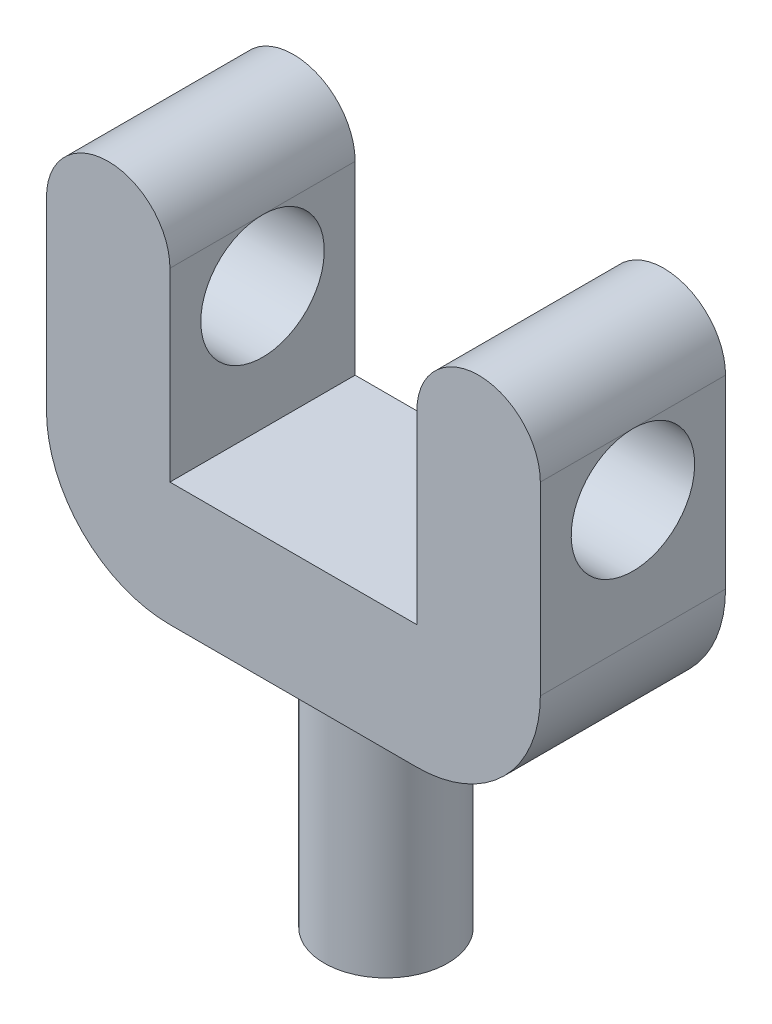
ISO-10303-21;
HEADER;
FILE_DESCRIPTION(('STEP AP214'),'2;1');
FILE_NAME('part.step','',(''),(''),'','','');
FILE_SCHEMA(('AUTOMOTIVE_DESIGN { 1 0 10303 214 1 1 1 1 }'));
ENDSEC;
DATA;
#1=APPLICATION_CONTEXT('core data for automotive mechanical design processes');
#2=APPLICATION_PROTOCOL_DEFINITION('international standard','automotive_design',2000,#1);
#3=PRODUCT_CONTEXT('',#1,'mechanical');
#4=PRODUCT('Part','Part','',(#3));
#5=PRODUCT_RELATED_PRODUCT_CATEGORY('part','',(#4));
#6=PRODUCT_DEFINITION_FORMATION('','',#4);
#7=PRODUCT_DEFINITION_CONTEXT('part definition',#1,'design');
#8=PRODUCT_DEFINITION('design','',#6,#7);
#9=PRODUCT_DEFINITION_SHAPE('','',#8);
#10=(LENGTH_UNIT() NAMED_UNIT(*) SI_UNIT(.MILLI.,.METRE.));
#11=(NAMED_UNIT(*) PLANE_ANGLE_UNIT() SI_UNIT($,.RADIAN.));
#12=(NAMED_UNIT(*) SI_UNIT($,.STERADIAN.) SOLID_ANGLE_UNIT());
#13=UNCERTAINTY_MEASURE_WITH_UNIT(LENGTH_MEASURE(1.E-05),#10,'distance_accuracy_value','');
#14=(GEOMETRIC_REPRESENTATION_CONTEXT(3) GLOBAL_UNCERTAINTY_ASSIGNED_CONTEXT((#13)) GLOBAL_UNIT_ASSIGNED_CONTEXT((#10,
#11,#12)) REPRESENTATION_CONTEXT('',''));
#15=CARTESIAN_POINT('',(0.,0.,0.));
#16=DIRECTION('',(0.,0.,1.));
#17=DIRECTION('',(1.,0.,0.));
#18=AXIS2_PLACEMENT_3D('',#15,#16,#17);
#19=CARTESIAN_POINT('',(-10.,5.,7.5));
#20=DIRECTION('',(0.,-1.,0.));
#21=DIRECTION('',(0.,0.,-1.));
#22=AXIS2_PLACEMENT_3D('',#19,#20,#21);
#23=PLANE('',#22);
#24=DIRECTION('',(-1.,0.,0.));
#25=VECTOR('',#24,1.);
#26=CARTESIAN_POINT('',(-10.,5.,-7.5));
#27=LINE('',#26,#25);
#28=CARTESIAN_POINT('',(10.,5.,-7.5));
#29=VERTEX_POINT('',#28);
#30=CARTESIAN_POINT('',(-10.,5.,-7.5));
#31=VERTEX_POINT('',#30);
#32=EDGE_CURVE('E156',#29,#31,#27,.T.);
#33=ORIENTED_EDGE('',*,*,#32,.T.);
#34=DIRECTION('',(0.,0.,-1.));
#35=VECTOR('',#34,1.);
#36=CARTESIAN_POINT('',(-10.,5.,7.5));
#37=LINE('',#36,#35);
#38=CARTESIAN_POINT('',(-10.,5.,7.5));
#39=VERTEX_POINT('',#38);
#40=EDGE_CURVE('E134',#39,#31,#37,.T.);
#41=ORIENTED_EDGE('',*,*,#40,.F.);
#42=DIRECTION('',(-1.,0.,0.));
#43=VECTOR('',#42,1.);
#44=CARTESIAN_POINT('',(-10.,5.,7.5));
#45=LINE('',#44,#43);
#46=CARTESIAN_POINT('',(10.,5.,7.5));
#47=VERTEX_POINT('',#46);
#48=EDGE_CURVE('E142',#47,#39,#45,.T.);
#49=ORIENTED_EDGE('',*,*,#48,.F.);
#50=DIRECTION('',(0.,0.,-1.));
#51=VECTOR('',#50,1.);
#52=CARTESIAN_POINT('',(10.,5.,7.5));
#53=LINE('',#52,#51);
#54=EDGE_CURVE('E240',#47,#29,#53,.T.);
#55=ORIENTED_EDGE('',*,*,#54,.T.);
#56=EDGE_LOOP('',(#33,#41,#49,#55));
#57=FACE_BOUND('',#56,.T.);
#58=ADVANCED_FACE('F39',(#57),#23,.F.);
#59=CARTESIAN_POINT('',(-10.,5.,7.5));
#60=DIRECTION('',(-1.,0.,0.));
#61=DIRECTION('',(0.,-1.,0.));
#62=AXIS2_PLACEMENT_3D('',#59,#60,#61);
#63=PLANE('',#62);
#64=DIRECTION('',(0.,0.,-1.));
#65=VECTOR('',#64,1.);
#66=CARTESIAN_POINT('',(-10.,20.,7.5));
#67=LINE('',#66,#65);
#68=CARTESIAN_POINT('',(-10.,20.,0.));
#69=VERTEX_POINT('',#68);
#70=CARTESIAN_POINT('',(-10.,20.,-7.5));
#71=VERTEX_POINT('',#70);
#72=EDGE_CURVE('E165',#69,#71,#67,.T.);
#73=ORIENTED_EDGE('',*,*,#72,.F.);
#74=CARTESIAN_POINT('',(-10.,15.,0.));
#75=DIRECTION('',(-1.,0.,0.));
#76=DIRECTION('',(0.,-1.,0.));
#77=AXIS2_PLACEMENT_3D('',#74,#75,#76);
#78=CIRCLE('',#77,5.);
#79=EDGE_CURVE('E54',#69,#69,#78,.T.);
#80=ORIENTED_EDGE('',*,*,#79,.T.);
#81=CARTESIAN_POINT('',(-10.,20.,7.5));
#82=VERTEX_POINT('',#81);
#83=EDGE_CURVE('E137',#82,#69,#67,.T.);
#84=ORIENTED_EDGE('',*,*,#83,.F.);
#85=DIRECTION('',(0.,1.,0.));
#86=VECTOR('',#85,1.);
#87=CARTESIAN_POINT('',(-10.,5.,7.5));
#88=LINE('',#87,#86);
#89=EDGE_CURVE('E128',#39,#82,#88,.T.);
#90=ORIENTED_EDGE('',*,*,#89,.F.);
#91=ORIENTED_EDGE('',*,*,#40,.T.);
#92=DIRECTION('',(0.,1.,0.));
#93=VECTOR('',#92,1.);
#94=CARTESIAN_POINT('',(-10.,5.,-7.5));
#95=LINE('',#94,#93);
#96=EDGE_CURVE('E227',#31,#71,#95,.T.);
#97=ORIENTED_EDGE('',*,*,#96,.T.);
#98=EDGE_LOOP('',(#73,#80,#84,#90,#91,#97));
#99=FACE_BOUND('',#98,.T.);
#100=ADVANCED_FACE('F131',(#99),#63,.F.);
#101=CARTESIAN_POINT('',(-15.,20.,7.5));
#102=DIRECTION('',(0.,0.,-1.));
#103=DIRECTION('',(-1.,0.,0.));
#104=AXIS2_PLACEMENT_3D('',#101,#102,#103);
#105=CYLINDRICAL_SURFACE('',#104,5.);
#106=CARTESIAN_POINT('',(-15.,20.,-7.5));
#107=DIRECTION('',(0.,0.,1.));
#108=DIRECTION('',(1.,0.,0.));
#109=AXIS2_PLACEMENT_3D('',#106,#107,#108);
#110=CIRCLE('',#109,5.);
#111=CARTESIAN_POINT('',(-20.,20.,-7.5));
#112=VERTEX_POINT('',#111);
#113=EDGE_CURVE('E221',#71,#112,#110,.T.);
#114=ORIENTED_EDGE('',*,*,#113,.T.);
#115=DIRECTION('',(0.,0.,-1.));
#116=VECTOR('',#115,1.);
#117=CARTESIAN_POINT('',(-20.,20.,7.5));
#118=LINE('',#117,#116);
#119=CARTESIAN_POINT('',(-20.,20.,0.));
#120=VERTEX_POINT('',#119);
#121=EDGE_CURVE('E218',#120,#112,#118,.T.);
#122=ORIENTED_EDGE('',*,*,#121,.F.);
#123=CARTESIAN_POINT('',(-20.,20.,7.5));
#124=VERTEX_POINT('',#123);
#125=EDGE_CURVE('E252',#124,#120,#118,.T.);
#126=ORIENTED_EDGE('',*,*,#125,.F.);
#127=CARTESIAN_POINT('',(-15.,20.,7.5));
#128=DIRECTION('',(0.,0.,1.));
#129=DIRECTION('',(1.,0.,0.));
#130=AXIS2_PLACEMENT_3D('',#127,#128,#129);
#131=CIRCLE('',#130,5.);
#132=EDGE_CURVE('E141',#82,#124,#131,.T.);
#133=ORIENTED_EDGE('',*,*,#132,.F.);
#134=ORIENTED_EDGE('',*,*,#83,.T.);
#135=ORIENTED_EDGE('',*,*,#72,.T.);
#136=EDGE_LOOP('',(#114,#122,#126,#133,#134,#135));
#137=FACE_BOUND('',#136,.T.);
#138=ADVANCED_FACE('F275',(#137),#105,.T.);
#139=CARTESIAN_POINT('',(-20.,-5.,7.5));
#140=DIRECTION('',(1.,0.,0.));
#141=DIRECTION('',(0.,1.,0.));
#142=AXIS2_PLACEMENT_3D('',#139,#140,#141);
#143=PLANE('',#142);
#144=ORIENTED_EDGE('',*,*,#125,.T.);
#145=CARTESIAN_POINT('',(-20.,15.,0.));
#146=DIRECTION('',(1.,0.,0.));
#147=DIRECTION('',(0.,1.,0.));
#148=AXIS2_PLACEMENT_3D('',#145,#146,#147);
#149=CIRCLE('',#148,5.);
#150=EDGE_CURVE('E59',#120,#120,#149,.F.);
#151=ORIENTED_EDGE('',*,*,#150,.F.);
#152=ORIENTED_EDGE('',*,*,#121,.T.);
#153=DIRECTION('',(0.,-1.,0.));
#154=VECTOR('',#153,1.);
#155=CARTESIAN_POINT('',(-20.,-5.,-7.5));
#156=LINE('',#155,#154);
#157=CARTESIAN_POINT('',(-20.,5.,-7.5));
#158=VERTEX_POINT('',#157);
#159=EDGE_CURVE('E212',#112,#158,#156,.T.);
#160=ORIENTED_EDGE('',*,*,#159,.T.);
#161=DIRECTION('',(0.,0.,-1.));
#162=VECTOR('',#161,1.);
#163=CARTESIAN_POINT('',(-20.,5.,7.5));
#164=LINE('',#163,#162);
#165=CARTESIAN_POINT('',(-20.,5.,7.5));
#166=VERTEX_POINT('',#165);
#167=EDGE_CURVE('E181',#158,#166,#164,.F.);
#168=ORIENTED_EDGE('',*,*,#167,.T.);
#169=DIRECTION('',(0.,-1.,0.));
#170=VECTOR('',#169,1.);
#171=CARTESIAN_POINT('',(-20.,-5.,7.5));
#172=LINE('',#171,#170);
#173=EDGE_CURVE('E194',#124,#166,#172,.T.);
#174=ORIENTED_EDGE('',*,*,#173,.F.);
#175=EDGE_LOOP('',(#144,#151,#152,#160,#168,#174));
#176=FACE_BOUND('',#175,.T.);
#177=ADVANCED_FACE('F216',(#176),#143,.F.);
#178=CARTESIAN_POINT('',(-20.,-5.,7.5));
#179=DIRECTION('',(0.,1.,0.));
#180=DIRECTION('',(0.,0.,1.));
#181=AXIS2_PLACEMENT_3D('',#178,#179,#180);
#182=PLANE('',#181);
#183=CARTESIAN_POINT('',(0.,-5.,0.));
#184=DIRECTION('',(0.,-1.,0.));
#185=DIRECTION('',(0.,0.,-1.));
#186=AXIS2_PLACEMENT_3D('',#183,#184,#185);
#187=CIRCLE('',#186,5.);
#188=CARTESIAN_POINT('',(0.,-5.,-5.));
#189=VERTEX_POINT('',#188);
#190=EDGE_CURVE('E158',#189,#189,#187,.T.);
#191=ORIENTED_EDGE('',*,*,#190,.F.);
#192=EDGE_LOOP('',(#191));
#193=FACE_BOUND('',#192,.T.);
#194=DIRECTION('',(1.,0.,0.));
#195=VECTOR('',#194,1.);
#196=CARTESIAN_POINT('',(-20.,-5.,7.5));
#197=LINE('',#196,#195);
#198=CARTESIAN_POINT('',(-10.,-5.,7.5));
#199=VERTEX_POINT('',#198);
#200=CARTESIAN_POINT('',(10.,-5.,7.5));
#201=VERTEX_POINT('',#200);
#202=EDGE_CURVE('E191',#199,#201,#197,.T.);
#203=ORIENTED_EDGE('',*,*,#202,.F.);
#204=DIRECTION('',(0.,0.,-1.));
#205=VECTOR('',#204,1.);
#206=CARTESIAN_POINT('',(-10.,-5.,7.5));
#207=LINE('',#206,#205);
#208=CARTESIAN_POINT('',(-10.,-5.,-7.5));
#209=VERTEX_POINT('',#208);
#210=EDGE_CURVE('E171',#199,#209,#207,.T.);
#211=ORIENTED_EDGE('',*,*,#210,.T.);
#212=DIRECTION('',(1.,0.,0.));
#213=VECTOR('',#212,1.);
#214=CARTESIAN_POINT('',(-20.,-5.,-7.5));
#215=LINE('',#214,#213);
#216=CARTESIAN_POINT('',(10.,-5.,-7.5));
#217=VERTEX_POINT('',#216);
#218=EDGE_CURVE('E213',#209,#217,#215,.T.);
#219=ORIENTED_EDGE('',*,*,#218,.T.);
#220=DIRECTION('',(0.,0.,-1.));
#221=VECTOR('',#220,1.);
#222=CARTESIAN_POINT('',(10.,-5.,7.5));
#223=LINE('',#222,#221);
#224=EDGE_CURVE('E163',#217,#201,#223,.F.);
#225=ORIENTED_EDGE('',*,*,#224,.T.);
#226=EDGE_LOOP('',(#203,#211,#219,#225));
#227=FACE_BOUND('',#226,.T.);
#228=ADVANCED_FACE('F199',(#193,#227),#182,.F.);
#229=CARTESIAN_POINT('',(20.,-5.,7.5));
#230=DIRECTION('',(-1.,0.,0.));
#231=DIRECTION('',(0.,-1.,0.));
#232=AXIS2_PLACEMENT_3D('',#229,#230,#231);
#233=PLANE('',#232);
#234=DIRECTION('',(0.,0.,-1.));
#235=VECTOR('',#234,1.);
#236=CARTESIAN_POINT('',(20.,20.,7.5));
#237=LINE('',#236,#235);
#238=CARTESIAN_POINT('',(20.,20.,0.));
#239=VERTEX_POINT('',#238);
#240=CARTESIAN_POINT('',(20.,20.,-7.5));
#241=VERTEX_POINT('',#240);
#242=EDGE_CURVE('E248',#239,#241,#237,.T.);
#243=ORIENTED_EDGE('',*,*,#242,.F.);
#244=CARTESIAN_POINT('',(20.,15.,0.));
#245=DIRECTION('',(1.,0.,0.));
#246=DIRECTION('',(0.,1.,0.));
#247=AXIS2_PLACEMENT_3D('',#244,#245,#246);
#248=CIRCLE('',#247,5.);
#249=EDGE_CURVE('E394',#239,#239,#248,.T.);
#250=ORIENTED_EDGE('',*,*,#249,.F.);
#251=CARTESIAN_POINT('',(20.,20.,7.5));
#252=VERTEX_POINT('',#251);
#253=EDGE_CURVE('E249',#252,#239,#237,.T.);
#254=ORIENTED_EDGE('',*,*,#253,.F.);
#255=DIRECTION('',(0.,1.,0.));
#256=VECTOR('',#255,1.);
#257=CARTESIAN_POINT('',(20.,-5.,7.5));
#258=LINE('',#257,#256);
#259=CARTESIAN_POINT('',(20.,5.,7.5));
#260=VERTEX_POINT('',#259);
#261=EDGE_CURVE('E204',#260,#252,#258,.T.);
#262=ORIENTED_EDGE('',*,*,#261,.F.);
#263=DIRECTION('',(0.,0.,-1.));
#264=VECTOR('',#263,1.);
#265=CARTESIAN_POINT('',(20.,5.,7.5));
#266=LINE('',#265,#264);
#267=CARTESIAN_POINT('',(20.,5.,-7.5));
#268=VERTEX_POINT('',#267);
#269=EDGE_CURVE('E11',#260,#268,#266,.T.);
#270=ORIENTED_EDGE('',*,*,#269,.T.);
#271=DIRECTION('',(0.,1.,0.));
#272=VECTOR('',#271,1.);
#273=CARTESIAN_POINT('',(20.,-5.,-7.5));
#274=LINE('',#273,#272);
#275=EDGE_CURVE('E225',#268,#241,#274,.T.);
#276=ORIENTED_EDGE('',*,*,#275,.T.);
#277=EDGE_LOOP('',(#243,#250,#254,#262,#270,#276));
#278=FACE_BOUND('',#277,.T.);
#279=ADVANCED_FACE('F319',(#278),#233,.F.);
#280=CARTESIAN_POINT('',(15.,20.,7.5));
#281=DIRECTION('',(0.,0.,-1.));
#282=DIRECTION('',(-1.,0.,0.));
#283=AXIS2_PLACEMENT_3D('',#280,#281,#282);
#284=CYLINDRICAL_SURFACE('',#283,5.);
#285=CARTESIAN_POINT('',(15.,20.,-7.5));
#286=DIRECTION('',(0.,0.,1.));
#287=DIRECTION('',(-1.,0.,0.));
#288=AXIS2_PLACEMENT_3D('',#285,#286,#287);
#289=CIRCLE('',#288,5.);
#290=CARTESIAN_POINT('',(10.,20.,-7.5));
#291=VERTEX_POINT('',#290);
#292=EDGE_CURVE('E234',#241,#291,#289,.T.);
#293=ORIENTED_EDGE('',*,*,#292,.T.);
#294=DIRECTION('',(0.,0.,-1.));
#295=VECTOR('',#294,1.);
#296=CARTESIAN_POINT('',(10.,20.,7.5));
#297=LINE('',#296,#295);
#298=CARTESIAN_POINT('',(10.,20.,0.));
#299=VERTEX_POINT('',#298);
#300=EDGE_CURVE('E243',#299,#291,#297,.T.);
#301=ORIENTED_EDGE('',*,*,#300,.F.);
#302=CARTESIAN_POINT('',(10.,20.,7.5));
#303=VERTEX_POINT('',#302);
#304=EDGE_CURVE('E244',#303,#299,#297,.T.);
#305=ORIENTED_EDGE('',*,*,#304,.F.);
#306=CARTESIAN_POINT('',(15.,20.,7.5));
#307=DIRECTION('',(0.,0.,1.));
#308=DIRECTION('',(-1.,0.,0.));
#309=AXIS2_PLACEMENT_3D('',#306,#307,#308);
#310=CIRCLE('',#309,5.);
#311=EDGE_CURVE('E261',#252,#303,#310,.T.);
#312=ORIENTED_EDGE('',*,*,#311,.F.);
#313=ORIENTED_EDGE('',*,*,#253,.T.);
#314=ORIENTED_EDGE('',*,*,#242,.T.);
#315=EDGE_LOOP('',(#293,#301,#305,#312,#313,#314));
#316=FACE_BOUND('',#315,.T.);
#317=ADVANCED_FACE('F315',(#316),#284,.T.);
#318=CARTESIAN_POINT('',(10.,5.,7.5));
#319=DIRECTION('',(1.,0.,0.));
#320=DIRECTION('',(0.,1.,0.));
#321=AXIS2_PLACEMENT_3D('',#318,#319,#320);
#322=PLANE('',#321);
#323=ORIENTED_EDGE('',*,*,#304,.T.);
#324=CARTESIAN_POINT('',(10.,15.,0.));
#325=DIRECTION('',(1.,0.,0.));
#326=DIRECTION('',(0.,1.,0.));
#327=AXIS2_PLACEMENT_3D('',#324,#325,#326);
#328=CIRCLE('',#327,5.);
#329=EDGE_CURVE('E43',#299,#299,#328,.T.);
#330=ORIENTED_EDGE('',*,*,#329,.T.);
#331=ORIENTED_EDGE('',*,*,#300,.T.);
#332=DIRECTION('',(0.,-1.,0.));
#333=VECTOR('',#332,1.);
#334=CARTESIAN_POINT('',(10.,5.,-7.5));
#335=LINE('',#334,#333);
#336=EDGE_CURVE('E153',#291,#29,#335,.T.);
#337=ORIENTED_EDGE('',*,*,#336,.T.);
#338=ORIENTED_EDGE('',*,*,#54,.F.);
#339=DIRECTION('',(0.,-1.,0.));
#340=VECTOR('',#339,1.);
#341=CARTESIAN_POINT('',(10.,5.,7.5));
#342=LINE('',#341,#340);
#343=EDGE_CURVE('E148',#303,#47,#342,.T.);
#344=ORIENTED_EDGE('',*,*,#343,.F.);
#345=EDGE_LOOP('',(#323,#330,#331,#337,#338,#344));
#346=FACE_BOUND('',#345,.T.);
#347=ADVANCED_FACE('F310',(#346),#322,.F.);
#348=CARTESIAN_POINT('',(15.,20.,7.5));
#349=DIRECTION('',(0.,0.,-1.));
#350=DIRECTION('',(-1.,0.,0.));
#351=AXIS2_PLACEMENT_3D('',#348,#349,#350);
#352=PLANE('',#351);
#353=ORIENTED_EDGE('',*,*,#173,.T.);
#354=CARTESIAN_POINT('',(-10.,5.,7.5));
#355=DIRECTION('',(0.,0.,-1.));
#356=DIRECTION('',(-1.,0.,0.));
#357=AXIS2_PLACEMENT_3D('',#354,#355,#356);
#358=CIRCLE('',#357,10.);
#359=EDGE_CURVE('E49',#166,#199,#358,.F.);
#360=ORIENTED_EDGE('',*,*,#359,.T.);
#361=ORIENTED_EDGE('',*,*,#202,.T.);
#362=CARTESIAN_POINT('',(10.,5.,7.5));
#363=DIRECTION('',(0.,0.,-1.));
#364=DIRECTION('',(-1.,0.,0.));
#365=AXIS2_PLACEMENT_3D('',#362,#363,#364);
#366=CIRCLE('',#365,10.);
#367=EDGE_CURVE('E184',#201,#260,#366,.F.);
#368=ORIENTED_EDGE('',*,*,#367,.T.);
#369=ORIENTED_EDGE('',*,*,#261,.T.);
#370=ORIENTED_EDGE('',*,*,#311,.T.);
#371=ORIENTED_EDGE('',*,*,#343,.T.);
#372=ORIENTED_EDGE('',*,*,#48,.T.);
#373=ORIENTED_EDGE('',*,*,#89,.T.);
#374=ORIENTED_EDGE('',*,*,#132,.T.);
#375=EDGE_LOOP('',(#353,#360,#361,#368,#369,#370,#371,#372,#373,#374));
#376=FACE_BOUND('',#375,.T.);
#377=ADVANCED_FACE('F146',(#376),#352,.F.);
#378=CARTESIAN_POINT('',(15.,20.,-7.5));
#379=DIRECTION('',(0.,0.,-1.));
#380=DIRECTION('',(-1.,0.,0.));
#381=AXIS2_PLACEMENT_3D('',#378,#379,#380);
#382=PLANE('',#381);
#383=ORIENTED_EDGE('',*,*,#218,.F.);
#384=CARTESIAN_POINT('',(-10.,5.,-7.5));
#385=DIRECTION('',(0.,0.,-1.));
#386=DIRECTION('',(-1.,0.,0.));
#387=AXIS2_PLACEMENT_3D('',#384,#385,#386);
#388=CIRCLE('',#387,10.);
#389=EDGE_CURVE('E178',#209,#158,#388,.T.);
#390=ORIENTED_EDGE('',*,*,#389,.T.);
#391=ORIENTED_EDGE('',*,*,#159,.F.);
#392=ORIENTED_EDGE('',*,*,#113,.F.);
#393=ORIENTED_EDGE('',*,*,#96,.F.);
#394=ORIENTED_EDGE('',*,*,#32,.F.);
#395=ORIENTED_EDGE('',*,*,#336,.F.);
#396=ORIENTED_EDGE('',*,*,#292,.F.);
#397=ORIENTED_EDGE('',*,*,#275,.F.);
#398=CARTESIAN_POINT('',(10.,5.,-7.5));
#399=DIRECTION('',(0.,0.,-1.));
#400=DIRECTION('',(-1.,0.,0.));
#401=AXIS2_PLACEMENT_3D('',#398,#399,#400);
#402=CIRCLE('',#401,10.);
#403=EDGE_CURVE('E175',#268,#217,#402,.T.);
#404=ORIENTED_EDGE('',*,*,#403,.T.);
#405=EDGE_LOOP('',(#383,#390,#391,#392,#393,#394,#395,#396,#397,#404));
#406=FACE_BOUND('',#405,.T.);
#407=ADVANCED_FACE('F210',(#406),#382,.T.);
#408=CARTESIAN_POINT('',(0.,-25.,0.));
#409=DIRECTION('',(0.,1.,0.));
#410=DIRECTION('',(0.,0.,1.));
#411=AXIS2_PLACEMENT_3D('',#408,#409,#410);
#412=CYLINDRICAL_SURFACE('',#411,5.);
#413=CARTESIAN_POINT('',(0.,-25.,0.));
#414=DIRECTION('',(0.,-1.,0.));
#415=DIRECTION('',(0.,0.,-1.));
#416=AXIS2_PLACEMENT_3D('',#413,#414,#415);
#417=CIRCLE('',#416,5.);
#418=CARTESIAN_POINT('',(0.,-25.,-5.));
#419=VERTEX_POINT('',#418);
#420=EDGE_CURVE('E272',#419,#419,#417,.T.);
#421=ORIENTED_EDGE('',*,*,#420,.F.);
#422=EDGE_LOOP('',(#421));
#423=FACE_BOUND('',#422,.T.);
#424=ORIENTED_EDGE('',*,*,#190,.T.);
#425=EDGE_LOOP('',(#424));
#426=FACE_BOUND('',#425,.T.);
#427=ADVANCED_FACE('F296',(#423,#426),#412,.T.);
#428=CARTESIAN_POINT('',(0.,-25.,0.));
#429=DIRECTION('',(0.,-1.,0.));
#430=DIRECTION('',(0.,0.,-1.));
#431=AXIS2_PLACEMENT_3D('',#428,#429,#430);
#432=PLANE('',#431);
#433=ORIENTED_EDGE('',*,*,#420,.T.);
#434=EDGE_LOOP('',(#433));
#435=FACE_BOUND('',#434,.T.);
#436=ADVANCED_FACE('F289',(#435),#432,.T.);
#437=CARTESIAN_POINT('',(-10.,5.,7.5));
#438=DIRECTION('',(0.,0.,-1.));
#439=DIRECTION('',(-1.,0.,0.));
#440=AXIS2_PLACEMENT_3D('',#437,#438,#439);
#441=CYLINDRICAL_SURFACE('',#440,10.);
#442=ORIENTED_EDGE('',*,*,#359,.F.);
#443=ORIENTED_EDGE('',*,*,#167,.F.);
#444=ORIENTED_EDGE('',*,*,#389,.F.);
#445=ORIENTED_EDGE('',*,*,#210,.F.);
#446=EDGE_LOOP('',(#442,#443,#444,#445));
#447=FACE_BOUND('',#446,.T.);
#448=ADVANCED_FACE('F206',(#447),#441,.T.);
#449=CARTESIAN_POINT('',(10.,5.,7.5));
#450=DIRECTION('',(0.,0.,-1.));
#451=DIRECTION('',(-1.,0.,0.));
#452=AXIS2_PLACEMENT_3D('',#449,#450,#451);
#453=CYLINDRICAL_SURFACE('',#452,10.);
#454=ORIENTED_EDGE('',*,*,#367,.F.);
#455=ORIENTED_EDGE('',*,*,#224,.F.);
#456=ORIENTED_EDGE('',*,*,#403,.F.);
#457=ORIENTED_EDGE('',*,*,#269,.F.);
#458=EDGE_LOOP('',(#454,#455,#456,#457));
#459=FACE_BOUND('',#458,.T.);
#460=ADVANCED_FACE('F41',(#459),#453,.T.);
#461=CARTESIAN_POINT('',(-34.142135623731,15.,0.));
#462=DIRECTION('',(1.,0.,0.));
#463=DIRECTION('',(0.,1.,0.));
#464=AXIS2_PLACEMENT_3D('',#461,#462,#463);
#465=CYLINDRICAL_SURFACE('',#464,5.);
#466=ORIENTED_EDGE('',*,*,#249,.T.);
#467=EDGE_LOOP('',(#466));
#468=FACE_BOUND('',#467,.T.);
#469=ORIENTED_EDGE('',*,*,#329,.F.);
#470=EDGE_LOOP('',(#469));
#471=FACE_BOUND('',#470,.T.);
#472=ADVANCED_FACE('F294',(#468,#471),#465,.F.);
#473=ORIENTED_EDGE('',*,*,#150,.T.);
#474=EDGE_LOOP('',(#473));
#475=FACE_BOUND('',#474,.T.);
#476=ORIENTED_EDGE('',*,*,#79,.F.);
#477=EDGE_LOOP('',(#476));
#478=FACE_BOUND('',#477,.T.);
#479=ADVANCED_FACE('F306',(#475,#478),#465,.F.);
#480=CLOSED_SHELL('',(#58,#100,#138,#177,#228,#279,#317,#347,#377,#407,#427,#436,#448,#460,#472,#479));
#481=MANIFOLD_SOLID_BREP('B2',#480);
#482=ADVANCED_BREP_SHAPE_REPRESENTATION('',(#18,#481),#14);
#483=SHAPE_DEFINITION_REPRESENTATION(#9,#482);
ENDSEC;
END-ISO-10303-21;
